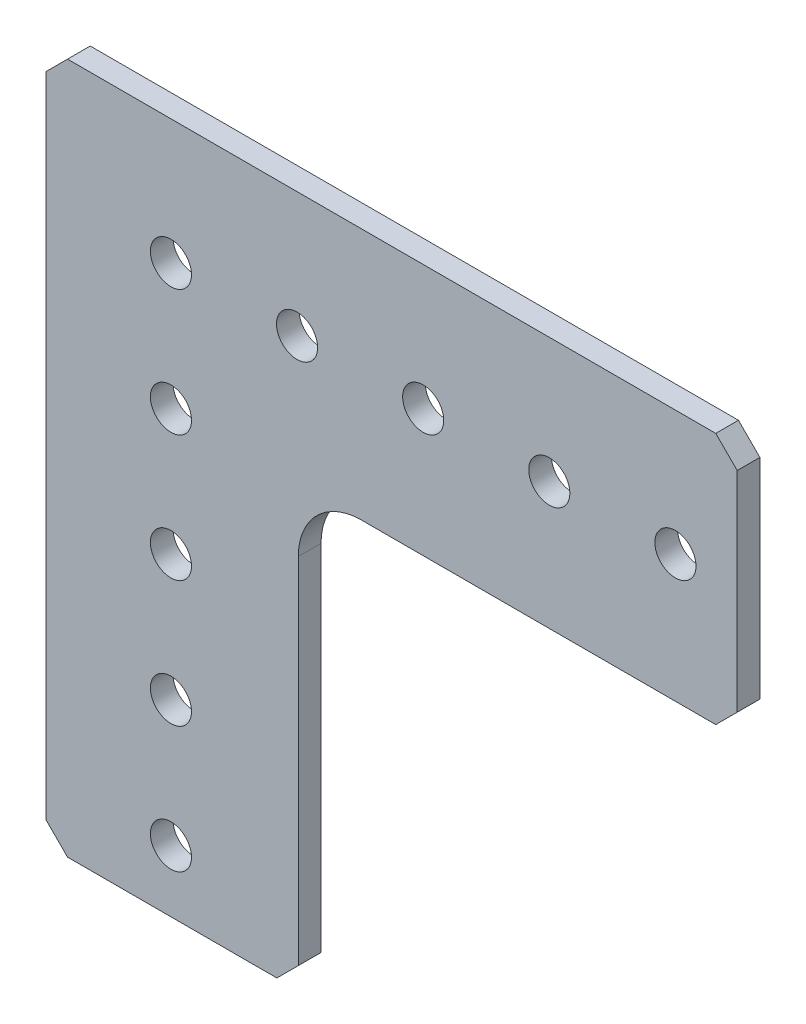
ISO-10303-21;
HEADER;
FILE_DESCRIPTION(('STEP AP214'),'2;1');
FILE_NAME('part.step','',(''),(''),'','','');
FILE_SCHEMA(('AUTOMOTIVE_DESIGN { 1 0 10303 214 1 1 1 1 }'));
ENDSEC;
DATA;
#1=APPLICATION_CONTEXT('core data for automotive mechanical design processes');
#2=APPLICATION_PROTOCOL_DEFINITION('international standard','automotive_design',2000,#1);
#3=PRODUCT_CONTEXT('',#1,'mechanical');
#4=PRODUCT('Part','Part','',(#3));
#5=PRODUCT_RELATED_PRODUCT_CATEGORY('part','',(#4));
#6=PRODUCT_DEFINITION_FORMATION('','',#4);
#7=PRODUCT_DEFINITION_CONTEXT('part definition',#1,'design');
#8=PRODUCT_DEFINITION('design','',#6,#7);
#9=PRODUCT_DEFINITION_SHAPE('','',#8);
#10=(LENGTH_UNIT() NAMED_UNIT(*) SI_UNIT(.MILLI.,.METRE.));
#11=(NAMED_UNIT(*) PLANE_ANGLE_UNIT() SI_UNIT($,.RADIAN.));
#12=(NAMED_UNIT(*) SI_UNIT($,.STERADIAN.) SOLID_ANGLE_UNIT());
#13=UNCERTAINTY_MEASURE_WITH_UNIT(LENGTH_MEASURE(1.E-05),#10,'distance_accuracy_value','');
#14=(GEOMETRIC_REPRESENTATION_CONTEXT(3) GLOBAL_UNCERTAINTY_ASSIGNED_CONTEXT((#13)) GLOBAL_UNIT_ASSIGNED_CONTEXT((#10,
#11,#12)) REPRESENTATION_CONTEXT('',''));
#15=CARTESIAN_POINT('',(0.,0.,0.));
#16=DIRECTION('',(0.,0.,1.));
#17=DIRECTION('',(1.,0.,0.));
#18=AXIS2_PLACEMENT_3D('',#15,#16,#17);
#19=CARTESIAN_POINT('',(-12.573,10.414,2.286));
#20=DIRECTION('',(-0.70710678118655,0.707106781186545,0.));
#21=DIRECTION('',(-0.707106781186545,-0.70710678118655,0.));
#22=AXIS2_PLACEMENT_3D('',#19,#20,#21);
#23=PLANE('',#22);
#24=DIRECTION('',(0.707106781186545,0.70710678118655,0.));
#25=VECTOR('',#24,1.);
#26=CARTESIAN_POINT('',(-12.573,10.414,0.));
#27=LINE('',#26,#25);
#28=CARTESIAN_POINT('',(-12.573,10.414,0.));
#29=VERTEX_POINT('',#28);
#30=CARTESIAN_POINT('',(-10.414,12.573,0.));
#31=VERTEX_POINT('',#30);
#32=EDGE_CURVE('E154',#29,#31,#27,.T.);
#33=ORIENTED_EDGE('',*,*,#32,.F.);
#34=DIRECTION('',(0.,0.,-1.));
#35=VECTOR('',#34,1.);
#36=CARTESIAN_POINT('',(-12.573,10.414,2.286));
#37=LINE('',#36,#35);
#38=CARTESIAN_POINT('',(-12.573,10.414,2.286));
#39=VERTEX_POINT('',#38);
#40=EDGE_CURVE('E11',#39,#29,#37,.T.);
#41=ORIENTED_EDGE('',*,*,#40,.F.);
#42=DIRECTION('',(0.707106781186545,0.70710678118655,0.));
#43=VECTOR('',#42,1.);
#44=CARTESIAN_POINT('',(-12.573,10.414,2.286));
#45=LINE('',#44,#43);
#46=CARTESIAN_POINT('',(-10.414,12.573,2.286));
#47=VERTEX_POINT('',#46);
#48=EDGE_CURVE('E187',#39,#47,#45,.T.);
#49=ORIENTED_EDGE('',*,*,#48,.T.);
#50=DIRECTION('',(0.,0.,-1.));
#51=VECTOR('',#50,1.);
#52=CARTESIAN_POINT('',(-10.414,12.573,2.286));
#53=LINE('',#52,#51);
#54=EDGE_CURVE('E36',#47,#31,#53,.T.);
#55=ORIENTED_EDGE('',*,*,#54,.T.);
#56=EDGE_LOOP('',(#33,#41,#49,#55));
#57=FACE_BOUND('',#56,.T.);
#58=ADVANCED_FACE('F33',(#57),#23,.T.);
#59=CARTESIAN_POINT('',(-12.573,-54.864,2.286));
#60=DIRECTION('',(-1.,0.,0.));
#61=DIRECTION('',(0.,-1.,0.));
#62=AXIS2_PLACEMENT_3D('',#59,#60,#61);
#63=PLANE('',#62);
#64=DIRECTION('',(0.,1.,0.));
#65=VECTOR('',#64,1.);
#66=CARTESIAN_POINT('',(-12.573,-54.864,0.));
#67=LINE('',#66,#65);
#68=CARTESIAN_POINT('',(-12.573,-54.864,0.));
#69=VERTEX_POINT('',#68);
#70=EDGE_CURVE('E185',#69,#29,#67,.T.);
#71=ORIENTED_EDGE('',*,*,#70,.F.);
#72=DIRECTION('',(0.,0.,-1.));
#73=VECTOR('',#72,1.);
#74=CARTESIAN_POINT('',(-12.573,-54.864,2.286));
#75=LINE('',#74,#73);
#76=CARTESIAN_POINT('',(-12.573,-54.864,2.286));
#77=VERTEX_POINT('',#76);
#78=EDGE_CURVE('E42',#77,#69,#75,.T.);
#79=ORIENTED_EDGE('',*,*,#78,.F.);
#80=DIRECTION('',(0.,1.,0.));
#81=VECTOR('',#80,1.);
#82=CARTESIAN_POINT('',(-12.573,-54.864,2.286));
#83=LINE('',#82,#81);
#84=EDGE_CURVE('E144',#77,#39,#83,.T.);
#85=ORIENTED_EDGE('',*,*,#84,.T.);
#86=ORIENTED_EDGE('',*,*,#40,.T.);
#87=EDGE_LOOP('',(#71,#79,#85,#86));
#88=FACE_BOUND('',#87,.T.);
#89=ADVANCED_FACE('F207',(#88),#63,.T.);
#90=CARTESIAN_POINT('',(-10.414,-57.023,2.286));
#91=DIRECTION('',(-0.70710678118654,-0.707106781186555,0.));
#92=DIRECTION('',(0.707106781186555,-0.70710678118654,0.));
#93=AXIS2_PLACEMENT_3D('',#90,#91,#92);
#94=PLANE('',#93);
#95=DIRECTION('',(-0.707106781186555,0.70710678118654,0.));
#96=VECTOR('',#95,1.);
#97=CARTESIAN_POINT('',(-10.414,-57.023,0.));
#98=LINE('',#97,#96);
#99=CARTESIAN_POINT('',(-10.414,-57.023,0.));
#100=VERTEX_POINT('',#99);
#101=EDGE_CURVE('E131',#100,#69,#98,.T.);
#102=ORIENTED_EDGE('',*,*,#101,.F.);
#103=DIRECTION('',(0.,0.,-1.));
#104=VECTOR('',#103,1.);
#105=CARTESIAN_POINT('',(-10.414,-57.023,2.286));
#106=LINE('',#105,#104);
#107=CARTESIAN_POINT('',(-10.414,-57.023,2.286));
#108=VERTEX_POINT('',#107);
#109=EDGE_CURVE('E126',#108,#100,#106,.T.);
#110=ORIENTED_EDGE('',*,*,#109,.F.);
#111=DIRECTION('',(-0.707106781186555,0.70710678118654,0.));
#112=VECTOR('',#111,1.);
#113=CARTESIAN_POINT('',(-10.414,-57.023,2.286));
#114=LINE('',#113,#112);
#115=EDGE_CURVE('E129',#108,#77,#114,.T.);
#116=ORIENTED_EDGE('',*,*,#115,.T.);
#117=ORIENTED_EDGE('',*,*,#78,.T.);
#118=EDGE_LOOP('',(#102,#110,#116,#117));
#119=FACE_BOUND('',#118,.T.);
#120=ADVANCED_FACE('F128',(#119),#94,.T.);
#121=CARTESIAN_POINT('',(10.668,-57.023,2.286));
#122=DIRECTION('',(0.,-1.,0.));
#123=DIRECTION('',(1.,0.,0.));
#124=AXIS2_PLACEMENT_3D('',#121,#122,#123);
#125=PLANE('',#124);
#126=DIRECTION('',(-1.,0.,0.));
#127=VECTOR('',#126,1.);
#128=CARTESIAN_POINT('',(10.668,-57.023,0.));
#129=LINE('',#128,#127);
#130=CARTESIAN_POINT('',(10.668,-57.023,0.));
#131=VERTEX_POINT('',#130);
#132=EDGE_CURVE('E182',#131,#100,#129,.T.);
#133=ORIENTED_EDGE('',*,*,#132,.F.);
#134=DIRECTION('',(0.,0.,-1.));
#135=VECTOR('',#134,1.);
#136=CARTESIAN_POINT('',(10.668,-57.023,2.286));
#137=LINE('',#136,#135);
#138=CARTESIAN_POINT('',(10.668,-57.023,2.286));
#139=VERTEX_POINT('',#138);
#140=EDGE_CURVE('E136',#139,#131,#137,.T.);
#141=ORIENTED_EDGE('',*,*,#140,.F.);
#142=DIRECTION('',(-1.,0.,0.));
#143=VECTOR('',#142,1.);
#144=CARTESIAN_POINT('',(10.668,-57.023,2.286));
#145=LINE('',#144,#143);
#146=EDGE_CURVE('E142',#139,#108,#145,.T.);
#147=ORIENTED_EDGE('',*,*,#146,.T.);
#148=ORIENTED_EDGE('',*,*,#109,.T.);
#149=EDGE_LOOP('',(#133,#141,#147,#148));
#150=FACE_BOUND('',#149,.T.);
#151=ADVANCED_FACE('F146',(#150),#125,.T.);
#152=CARTESIAN_POINT('',(12.827,-54.864,2.286));
#153=DIRECTION('',(0.707106781186551,-0.707106781186544,0.));
#154=DIRECTION('',(0.707106781186544,0.707106781186551,0.));
#155=AXIS2_PLACEMENT_3D('',#152,#153,#154);
#156=PLANE('',#155);
#157=DIRECTION('',(-0.707106781186544,-0.707106781186551,0.));
#158=VECTOR('',#157,1.);
#159=CARTESIAN_POINT('',(12.827,-54.864,0.));
#160=LINE('',#159,#158);
#161=CARTESIAN_POINT('',(12.827,-54.864,0.));
#162=VERTEX_POINT('',#161);
#163=EDGE_CURVE('E179',#162,#131,#160,.T.);
#164=ORIENTED_EDGE('',*,*,#163,.F.);
#165=DIRECTION('',(0.,0.,-1.));
#166=VECTOR('',#165,1.);
#167=CARTESIAN_POINT('',(12.827,-54.864,2.286));
#168=LINE('',#167,#166);
#169=CARTESIAN_POINT('',(12.827,-54.864,2.286));
#170=VERTEX_POINT('',#169);
#171=EDGE_CURVE('E191',#170,#162,#168,.T.);
#172=ORIENTED_EDGE('',*,*,#171,.F.);
#173=DIRECTION('',(-0.707106781186544,-0.707106781186551,0.));
#174=VECTOR('',#173,1.);
#175=CARTESIAN_POINT('',(12.827,-54.864,2.286));
#176=LINE('',#175,#174);
#177=EDGE_CURVE('E147',#170,#139,#176,.T.);
#178=ORIENTED_EDGE('',*,*,#177,.T.);
#179=ORIENTED_EDGE('',*,*,#140,.T.);
#180=EDGE_LOOP('',(#164,#172,#178,#179));
#181=FACE_BOUND('',#180,.T.);
#182=ADVANCED_FACE('F220',(#181),#156,.T.);
#183=CARTESIAN_POINT('',(12.827,-19.177,2.286));
#184=DIRECTION('',(1.,0.,0.));
#185=DIRECTION('',(0.,1.,0.));
#186=AXIS2_PLACEMENT_3D('',#183,#184,#185);
#187=PLANE('',#186);
#188=DIRECTION('',(0.,-1.,0.));
#189=VECTOR('',#188,1.);
#190=CARTESIAN_POINT('',(12.827,-19.177,0.));
#191=LINE('',#190,#189);
#192=CARTESIAN_POINT('',(12.827,-19.177,0.));
#193=VERTEX_POINT('',#192);
#194=EDGE_CURVE('E176',#193,#162,#191,.T.);
#195=ORIENTED_EDGE('',*,*,#194,.F.);
#196=DIRECTION('',(0.,0.,-1.));
#197=VECTOR('',#196,1.);
#198=CARTESIAN_POINT('',(12.827,-19.177,2.286));
#199=LINE('',#198,#197);
#200=CARTESIAN_POINT('',(12.827,-19.177,2.286));
#201=VERTEX_POINT('',#200);
#202=EDGE_CURVE('E193',#201,#193,#199,.T.);
#203=ORIENTED_EDGE('',*,*,#202,.F.);
#204=DIRECTION('',(0.,-1.,0.));
#205=VECTOR('',#204,1.);
#206=CARTESIAN_POINT('',(12.827,-19.177,2.286));
#207=LINE('',#206,#205);
#208=EDGE_CURVE('E149',#201,#170,#207,.T.);
#209=ORIENTED_EDGE('',*,*,#208,.T.);
#210=ORIENTED_EDGE('',*,*,#171,.T.);
#211=EDGE_LOOP('',(#195,#203,#209,#210));
#212=FACE_BOUND('',#211,.T.);
#213=ADVANCED_FACE('F223',(#212),#187,.T.);
#214=CARTESIAN_POINT('',(19.177,-19.177,2.286));
#215=DIRECTION('',(0.,0.,-1.));
#216=DIRECTION('',(-1.,0.,0.));
#217=AXIS2_PLACEMENT_3D('',#214,#215,#216);
#218=CYLINDRICAL_SURFACE('',#217,6.35);
#219=CARTESIAN_POINT('',(19.177,-19.177,0.));
#220=DIRECTION('',(0.,0.,1.));
#221=DIRECTION('',(1.,0.,0.));
#222=AXIS2_PLACEMENT_3D('',#219,#220,#221);
#223=CIRCLE('',#222,6.35);
#224=CARTESIAN_POINT('',(19.177,-12.827,0.));
#225=VERTEX_POINT('',#224);
#226=EDGE_CURVE('E173',#225,#193,#223,.T.);
#227=ORIENTED_EDGE('',*,*,#226,.F.);
#228=DIRECTION('',(0.,0.,-1.));
#229=VECTOR('',#228,1.);
#230=CARTESIAN_POINT('',(19.177,-12.827,2.286));
#231=LINE('',#230,#229);
#232=CARTESIAN_POINT('',(19.177,-12.827,2.286));
#233=VERTEX_POINT('',#232);
#234=EDGE_CURVE('E195',#233,#225,#231,.T.);
#235=ORIENTED_EDGE('',*,*,#234,.F.);
#236=CARTESIAN_POINT('',(19.177,-19.177,2.286));
#237=DIRECTION('',(0.,0.,1.));
#238=DIRECTION('',(1.,0.,0.));
#239=AXIS2_PLACEMENT_3D('',#236,#237,#238);
#240=CIRCLE('',#239,6.35);
#241=EDGE_CURVE('E367',#233,#201,#240,.T.);
#242=ORIENTED_EDGE('',*,*,#241,.T.);
#243=ORIENTED_EDGE('',*,*,#202,.T.);
#244=EDGE_LOOP('',(#227,#235,#242,#243));
#245=FACE_BOUND('',#244,.T.);
#246=ADVANCED_FACE('F227',(#245),#218,.F.);
#247=CARTESIAN_POINT('',(54.864,-12.827,2.286));
#248=DIRECTION('',(0.,-1.,0.));
#249=DIRECTION('',(1.,0.,0.));
#250=AXIS2_PLACEMENT_3D('',#247,#248,#249);
#251=PLANE('',#250);
#252=DIRECTION('',(-1.,0.,0.));
#253=VECTOR('',#252,1.);
#254=CARTESIAN_POINT('',(54.864,-12.827,0.));
#255=LINE('',#254,#253);
#256=CARTESIAN_POINT('',(54.864,-12.827,0.));
#257=VERTEX_POINT('',#256);
#258=EDGE_CURVE('E170',#257,#225,#255,.T.);
#259=ORIENTED_EDGE('',*,*,#258,.F.);
#260=DIRECTION('',(0.,0.,-1.));
#261=VECTOR('',#260,1.);
#262=CARTESIAN_POINT('',(54.864,-12.827,2.286));
#263=LINE('',#262,#261);
#264=CARTESIAN_POINT('',(54.864,-12.827,2.286));
#265=VERTEX_POINT('',#264);
#266=EDGE_CURVE('E197',#265,#257,#263,.T.);
#267=ORIENTED_EDGE('',*,*,#266,.F.);
#268=DIRECTION('',(-1.,0.,0.));
#269=VECTOR('',#268,1.);
#270=CARTESIAN_POINT('',(54.864,-12.827,2.286));
#271=LINE('',#270,#269);
#272=EDGE_CURVE('E364',#265,#233,#271,.T.);
#273=ORIENTED_EDGE('',*,*,#272,.T.);
#274=ORIENTED_EDGE('',*,*,#234,.T.);
#275=EDGE_LOOP('',(#259,#267,#273,#274));
#276=FACE_BOUND('',#275,.T.);
#277=ADVANCED_FACE('F231',(#276),#251,.T.);
#278=CARTESIAN_POINT('',(57.023,-10.668,2.286));
#279=DIRECTION('',(0.707106781186546,-0.707106781186549,0.));
#280=DIRECTION('',(0.707106781186549,0.707106781186546,0.));
#281=AXIS2_PLACEMENT_3D('',#278,#279,#280);
#282=PLANE('',#281);
#283=DIRECTION('',(-0.707106781186549,-0.707106781186546,0.));
#284=VECTOR('',#283,1.);
#285=CARTESIAN_POINT('',(57.023,-10.668,0.));
#286=LINE('',#285,#284);
#287=CARTESIAN_POINT('',(57.023,-10.668,0.));
#288=VERTEX_POINT('',#287);
#289=EDGE_CURVE('E167',#288,#257,#286,.T.);
#290=ORIENTED_EDGE('',*,*,#289,.F.);
#291=DIRECTION('',(0.,0.,-1.));
#292=VECTOR('',#291,1.);
#293=CARTESIAN_POINT('',(57.023,-10.668,2.286));
#294=LINE('',#293,#292);
#295=CARTESIAN_POINT('',(57.023,-10.668,2.286));
#296=VERTEX_POINT('',#295);
#297=EDGE_CURVE('E199',#296,#288,#294,.T.);
#298=ORIENTED_EDGE('',*,*,#297,.F.);
#299=DIRECTION('',(-0.707106781186549,-0.707106781186546,0.));
#300=VECTOR('',#299,1.);
#301=CARTESIAN_POINT('',(57.023,-10.668,2.286));
#302=LINE('',#301,#300);
#303=EDGE_CURVE('E361',#296,#265,#302,.T.);
#304=ORIENTED_EDGE('',*,*,#303,.T.);
#305=ORIENTED_EDGE('',*,*,#266,.T.);
#306=EDGE_LOOP('',(#290,#298,#304,#305));
#307=FACE_BOUND('',#306,.T.);
#308=ADVANCED_FACE('F235',(#307),#282,.T.);
#309=CARTESIAN_POINT('',(57.023,10.414,2.286));
#310=DIRECTION('',(1.,0.,0.));
#311=DIRECTION('',(0.,1.,0.));
#312=AXIS2_PLACEMENT_3D('',#309,#310,#311);
#313=PLANE('',#312);
#314=DIRECTION('',(0.,-1.,0.));
#315=VECTOR('',#314,1.);
#316=CARTESIAN_POINT('',(57.023,10.414,0.));
#317=LINE('',#316,#315);
#318=CARTESIAN_POINT('',(57.023,10.414,0.));
#319=VERTEX_POINT('',#318);
#320=EDGE_CURVE('E164',#319,#288,#317,.T.);
#321=ORIENTED_EDGE('',*,*,#320,.F.);
#322=DIRECTION('',(0.,0.,-1.));
#323=VECTOR('',#322,1.);
#324=CARTESIAN_POINT('',(57.023,10.414,2.286));
#325=LINE('',#324,#323);
#326=CARTESIAN_POINT('',(57.023,10.414,2.286));
#327=VERTEX_POINT('',#326);
#328=EDGE_CURVE('E201',#327,#319,#325,.T.);
#329=ORIENTED_EDGE('',*,*,#328,.F.);
#330=DIRECTION('',(0.,-1.,0.));
#331=VECTOR('',#330,1.);
#332=CARTESIAN_POINT('',(57.023,10.414,2.286));
#333=LINE('',#332,#331);
#334=EDGE_CURVE('E358',#327,#296,#333,.T.);
#335=ORIENTED_EDGE('',*,*,#334,.T.);
#336=ORIENTED_EDGE('',*,*,#297,.T.);
#337=EDGE_LOOP('',(#321,#329,#335,#336));
#338=FACE_BOUND('',#337,.T.);
#339=ADVANCED_FACE('F239',(#338),#313,.T.);
#340=CARTESIAN_POINT('',(54.864,12.573,2.286));
#341=DIRECTION('',(0.707106781186542,0.707106781186554,0.));
#342=DIRECTION('',(-0.707106781186554,0.707106781186542,0.));
#343=AXIS2_PLACEMENT_3D('',#340,#341,#342);
#344=PLANE('',#343);
#345=DIRECTION('',(0.707106781186553,-0.707106781186541,0.));
#346=VECTOR('',#345,1.);
#347=CARTESIAN_POINT('',(54.864,12.573,0.));
#348=LINE('',#347,#346);
#349=CARTESIAN_POINT('',(54.864,12.573,0.));
#350=VERTEX_POINT('',#349);
#351=EDGE_CURVE('E161',#350,#319,#348,.T.);
#352=ORIENTED_EDGE('',*,*,#351,.F.);
#353=DIRECTION('',(0.,0.,-1.));
#354=VECTOR('',#353,1.);
#355=CARTESIAN_POINT('',(54.864,12.573,2.286));
#356=LINE('',#355,#354);
#357=CARTESIAN_POINT('',(54.864,12.573,2.286));
#358=VERTEX_POINT('',#357);
#359=EDGE_CURVE('E202',#358,#350,#356,.T.);
#360=ORIENTED_EDGE('',*,*,#359,.F.);
#361=DIRECTION('',(0.707106781186553,-0.707106781186541,0.));
#362=VECTOR('',#361,1.);
#363=CARTESIAN_POINT('',(54.864,12.573,2.286));
#364=LINE('',#363,#362);
#365=EDGE_CURVE('E355',#358,#327,#364,.T.);
#366=ORIENTED_EDGE('',*,*,#365,.T.);
#367=ORIENTED_EDGE('',*,*,#328,.T.);
#368=EDGE_LOOP('',(#352,#360,#366,#367));
#369=FACE_BOUND('',#368,.T.);
#370=ADVANCED_FACE('F243',(#369),#344,.T.);
#371=CARTESIAN_POINT('',(-10.414,12.573,2.286));
#372=DIRECTION('',(0.,1.,0.));
#373=DIRECTION('',(0.,0.,1.));
#374=AXIS2_PLACEMENT_3D('',#371,#372,#373);
#375=PLANE('',#374);
#376=DIRECTION('',(1.,0.,0.));
#377=VECTOR('',#376,1.);
#378=CARTESIAN_POINT('',(-10.414,12.573,0.));
#379=LINE('',#378,#377);
#380=EDGE_CURVE('E157',#31,#350,#379,.T.);
#381=ORIENTED_EDGE('',*,*,#380,.F.);
#382=ORIENTED_EDGE('',*,*,#54,.F.);
#383=DIRECTION('',(1.,0.,0.));
#384=VECTOR('',#383,1.);
#385=CARTESIAN_POINT('',(-10.414,12.573,2.286));
#386=LINE('',#385,#384);
#387=EDGE_CURVE('E353',#47,#358,#386,.T.);
#388=ORIENTED_EDGE('',*,*,#387,.T.);
#389=ORIENTED_EDGE('',*,*,#359,.T.);
#390=EDGE_LOOP('',(#381,#382,#388,#389));
#391=FACE_BOUND('',#390,.T.);
#392=ADVANCED_FACE('F204',(#391),#375,.T.);
#393=CARTESIAN_POINT('',(19.177,-19.177,2.286));
#394=DIRECTION('',(0.,0.,1.));
#395=DIRECTION('',(1.,0.,0.));
#396=AXIS2_PLACEMENT_3D('',#393,#394,#395);
#397=PLANE('',#396);
#398=CARTESIAN_POINT('',(50.8,0.,2.286));
#399=DIRECTION('',(0.,0.,-1.));
#400=DIRECTION('',(1.,0.,0.));
#401=AXIS2_PLACEMENT_3D('',#398,#399,#400);
#402=CIRCLE('',#401,2.0701);
#403=CARTESIAN_POINT('',(52.8701,0.,2.286));
#404=VERTEX_POINT('',#403);
#405=EDGE_CURVE('E298',#404,#404,#402,.T.);
#406=ORIENTED_EDGE('',*,*,#405,.T.);
#407=EDGE_LOOP('',(#406));
#408=FACE_BOUND('',#407,.T.);
#409=CARTESIAN_POINT('',(3.9907631702977E-13,-38.1,2.286));
#410=DIRECTION('',(0.,0.,-1.));
#411=DIRECTION('',(1.,0.,0.));
#412=AXIS2_PLACEMENT_3D('',#409,#410,#411);
#413=CIRCLE('',#412,2.0701);
#414=CARTESIAN_POINT('',(2.0701000000004,-38.1,2.286));
#415=VERTEX_POINT('',#414);
#416=EDGE_CURVE('E306',#415,#415,#413,.T.);
#417=ORIENTED_EDGE('',*,*,#416,.T.);
#418=EDGE_LOOP('',(#417));
#419=FACE_BOUND('',#418,.T.);
#420=CARTESIAN_POINT('',(1.33025439009923E-13,-12.7,2.286));
#421=DIRECTION('',(0.,0.,-1.));
#422=DIRECTION('',(1.,0.,0.));
#423=AXIS2_PLACEMENT_3D('',#420,#421,#422);
#424=CIRCLE('',#423,2.0701);
#425=CARTESIAN_POINT('',(2.07010000000013,-12.7,2.286));
#426=VERTEX_POINT('',#425);
#427=EDGE_CURVE('E312',#426,#426,#424,.T.);
#428=ORIENTED_EDGE('',*,*,#427,.T.);
#429=EDGE_LOOP('',(#428));
#430=FACE_BOUND('',#429,.T.);
#431=CARTESIAN_POINT('',(25.4,3.54734504026462E-13,2.286));
#432=DIRECTION('',(0.,0.,-1.));
#433=DIRECTION('',(1.,0.,0.));
#434=AXIS2_PLACEMENT_3D('',#431,#432,#433);
#435=CIRCLE('',#434,2.0701);
#436=CARTESIAN_POINT('',(27.4701,3.54734504026462E-13,2.286));
#437=VERTEX_POINT('',#436);
#438=EDGE_CURVE('E318',#437,#437,#435,.T.);
#439=ORIENTED_EDGE('',*,*,#438,.T.);
#440=EDGE_LOOP('',(#439));
#441=FACE_BOUND('',#440,.T.);
#442=CARTESIAN_POINT('',(0.,0.,2.286));
#443=DIRECTION('',(0.,0.,-1.));
#444=DIRECTION('',(1.,0.,0.));
#445=AXIS2_PLACEMENT_3D('',#442,#443,#444);
#446=CIRCLE('',#445,2.0701);
#447=CARTESIAN_POINT('',(2.0701,0.,2.286));
#448=VERTEX_POINT('',#447);
#449=EDGE_CURVE('E324',#448,#448,#446,.T.);
#450=ORIENTED_EDGE('',*,*,#449,.T.);
#451=EDGE_LOOP('',(#450));
#452=FACE_BOUND('',#451,.T.);
#453=CARTESIAN_POINT('',(12.7,1.77367252013231E-13,2.286));
#454=DIRECTION('',(0.,0.,-1.));
#455=DIRECTION('',(1.,0.,0.));
#456=AXIS2_PLACEMENT_3D('',#453,#454,#455);
#457=CIRCLE('',#456,2.0701);
#458=CARTESIAN_POINT('',(14.7701,1.77367252013231E-13,2.286));
#459=VERTEX_POINT('',#458);
#460=EDGE_CURVE('E330',#459,#459,#457,.T.);
#461=ORIENTED_EDGE('',*,*,#460,.T.);
#462=EDGE_LOOP('',(#461));
#463=FACE_BOUND('',#462,.T.);
#464=CARTESIAN_POINT('',(38.1,0.,2.286));
#465=DIRECTION('',(0.,0.,-1.));
#466=DIRECTION('',(1.,0.,0.));
#467=AXIS2_PLACEMENT_3D('',#464,#465,#466);
#468=CIRCLE('',#467,2.0701);
#469=CARTESIAN_POINT('',(40.1701,0.,2.286));
#470=VERTEX_POINT('',#469);
#471=EDGE_CURVE('E336',#470,#470,#468,.T.);
#472=ORIENTED_EDGE('',*,*,#471,.T.);
#473=EDGE_LOOP('',(#472));
#474=FACE_BOUND('',#473,.T.);
#475=CARTESIAN_POINT('',(2.66050878019847E-13,-25.4,2.286));
#476=DIRECTION('',(0.,0.,-1.));
#477=DIRECTION('',(1.,0.,0.));
#478=AXIS2_PLACEMENT_3D('',#475,#476,#477);
#479=CIRCLE('',#478,2.0701);
#480=CARTESIAN_POINT('',(2.07010000000027,-25.4,2.286));
#481=VERTEX_POINT('',#480);
#482=EDGE_CURVE('E342',#481,#481,#479,.T.);
#483=ORIENTED_EDGE('',*,*,#482,.T.);
#484=EDGE_LOOP('',(#483));
#485=FACE_BOUND('',#484,.T.);
#486=CARTESIAN_POINT('',(0.,-50.8,2.286));
#487=DIRECTION('',(0.,0.,-1.));
#488=DIRECTION('',(1.,0.,0.));
#489=AXIS2_PLACEMENT_3D('',#486,#487,#488);
#490=CIRCLE('',#489,2.0701);
#491=CARTESIAN_POINT('',(2.07010000000001,-50.8,2.286));
#492=VERTEX_POINT('',#491);
#493=EDGE_CURVE('E158',#492,#492,#490,.T.);
#494=ORIENTED_EDGE('',*,*,#493,.T.);
#495=EDGE_LOOP('',(#494));
#496=FACE_BOUND('',#495,.T.);
#497=ORIENTED_EDGE('',*,*,#48,.F.);
#498=ORIENTED_EDGE('',*,*,#84,.F.);
#499=ORIENTED_EDGE('',*,*,#115,.F.);
#500=ORIENTED_EDGE('',*,*,#146,.F.);
#501=ORIENTED_EDGE('',*,*,#177,.F.);
#502=ORIENTED_EDGE('',*,*,#208,.F.);
#503=ORIENTED_EDGE('',*,*,#241,.F.);
#504=ORIENTED_EDGE('',*,*,#272,.F.);
#505=ORIENTED_EDGE('',*,*,#303,.F.);
#506=ORIENTED_EDGE('',*,*,#334,.F.);
#507=ORIENTED_EDGE('',*,*,#365,.F.);
#508=ORIENTED_EDGE('',*,*,#387,.F.);
#509=EDGE_LOOP('',(#497,#498,#499,#500,#501,#502,#503,#504,#505,#506,#507,#508));
#510=FACE_BOUND('',#509,.T.);
#511=ADVANCED_FACE('F140',(#408,#419,#430,#441,#452,#463,#474,#485,#496,#510),#397,.T.);
#512=CARTESIAN_POINT('',(19.177,-19.177,0.));
#513=DIRECTION('',(0.,0.,1.));
#514=DIRECTION('',(1.,0.,0.));
#515=AXIS2_PLACEMENT_3D('',#512,#513,#514);
#516=PLANE('',#515);
#517=CARTESIAN_POINT('',(50.8,0.,0.));
#518=DIRECTION('',(0.,0.,-1.));
#519=DIRECTION('',(1.,0.,0.));
#520=AXIS2_PLACEMENT_3D('',#517,#518,#519);
#521=CIRCLE('',#520,2.0701);
#522=CARTESIAN_POINT('',(52.8701,0.,0.));
#523=VERTEX_POINT('',#522);
#524=EDGE_CURVE('E301',#523,#523,#521,.T.);
#525=ORIENTED_EDGE('',*,*,#524,.F.);
#526=EDGE_LOOP('',(#525));
#527=FACE_BOUND('',#526,.T.);
#528=CARTESIAN_POINT('',(3.9907631702977E-13,-38.1,0.));
#529=DIRECTION('',(0.,0.,-1.));
#530=DIRECTION('',(1.,0.,0.));
#531=AXIS2_PLACEMENT_3D('',#528,#529,#530);
#532=CIRCLE('',#531,2.0701);
#533=CARTESIAN_POINT('',(2.0701000000004,-38.1,0.));
#534=VERTEX_POINT('',#533);
#535=EDGE_CURVE('E303',#534,#534,#532,.T.);
#536=ORIENTED_EDGE('',*,*,#535,.F.);
#537=EDGE_LOOP('',(#536));
#538=FACE_BOUND('',#537,.T.);
#539=CARTESIAN_POINT('',(1.33025439009923E-13,-12.7,0.));
#540=DIRECTION('',(0.,0.,-1.));
#541=DIRECTION('',(1.,0.,0.));
#542=AXIS2_PLACEMENT_3D('',#539,#540,#541);
#543=CIRCLE('',#542,2.0701);
#544=CARTESIAN_POINT('',(2.07010000000013,-12.7,0.));
#545=VERTEX_POINT('',#544);
#546=EDGE_CURVE('E309',#545,#545,#543,.T.);
#547=ORIENTED_EDGE('',*,*,#546,.F.);
#548=EDGE_LOOP('',(#547));
#549=FACE_BOUND('',#548,.T.);
#550=CARTESIAN_POINT('',(25.4,3.54734504026462E-13,0.));
#551=DIRECTION('',(0.,0.,-1.));
#552=DIRECTION('',(1.,0.,0.));
#553=AXIS2_PLACEMENT_3D('',#550,#551,#552);
#554=CIRCLE('',#553,2.0701);
#555=CARTESIAN_POINT('',(27.4701,3.54734504026462E-13,0.));
#556=VERTEX_POINT('',#555);
#557=EDGE_CURVE('E315',#556,#556,#554,.T.);
#558=ORIENTED_EDGE('',*,*,#557,.F.);
#559=EDGE_LOOP('',(#558));
#560=FACE_BOUND('',#559,.T.);
#561=CARTESIAN_POINT('',(0.,0.,0.));
#562=DIRECTION('',(0.,0.,-1.));
#563=DIRECTION('',(1.,0.,0.));
#564=AXIS2_PLACEMENT_3D('',#561,#562,#563);
#565=CIRCLE('',#564,2.0701);
#566=CARTESIAN_POINT('',(2.0701,0.,0.));
#567=VERTEX_POINT('',#566);
#568=EDGE_CURVE('E321',#567,#567,#565,.T.);
#569=ORIENTED_EDGE('',*,*,#568,.F.);
#570=EDGE_LOOP('',(#569));
#571=FACE_BOUND('',#570,.T.);
#572=CARTESIAN_POINT('',(12.7,1.77367252013231E-13,0.));
#573=DIRECTION('',(0.,0.,-1.));
#574=DIRECTION('',(1.,0.,0.));
#575=AXIS2_PLACEMENT_3D('',#572,#573,#574);
#576=CIRCLE('',#575,2.0701);
#577=CARTESIAN_POINT('',(14.7701,1.77367252013231E-13,0.));
#578=VERTEX_POINT('',#577);
#579=EDGE_CURVE('E327',#578,#578,#576,.T.);
#580=ORIENTED_EDGE('',*,*,#579,.F.);
#581=EDGE_LOOP('',(#580));
#582=FACE_BOUND('',#581,.T.);
#583=CARTESIAN_POINT('',(38.1,0.,0.));
#584=DIRECTION('',(0.,0.,-1.));
#585=DIRECTION('',(1.,0.,0.));
#586=AXIS2_PLACEMENT_3D('',#583,#584,#585);
#587=CIRCLE('',#586,2.0701);
#588=CARTESIAN_POINT('',(40.1701,0.,0.));
#589=VERTEX_POINT('',#588);
#590=EDGE_CURVE('E333',#589,#589,#587,.T.);
#591=ORIENTED_EDGE('',*,*,#590,.F.);
#592=EDGE_LOOP('',(#591));
#593=FACE_BOUND('',#592,.T.);
#594=CARTESIAN_POINT('',(2.66050878019847E-13,-25.4,0.));
#595=DIRECTION('',(0.,0.,-1.));
#596=DIRECTION('',(1.,0.,0.));
#597=AXIS2_PLACEMENT_3D('',#594,#595,#596);
#598=CIRCLE('',#597,2.0701);
#599=CARTESIAN_POINT('',(2.07010000000027,-25.4,0.));
#600=VERTEX_POINT('',#599);
#601=EDGE_CURVE('E339',#600,#600,#598,.T.);
#602=ORIENTED_EDGE('',*,*,#601,.F.);
#603=EDGE_LOOP('',(#602));
#604=FACE_BOUND('',#603,.T.);
#605=CARTESIAN_POINT('',(0.,-50.8,0.));
#606=DIRECTION('',(0.,0.,-1.));
#607=DIRECTION('',(1.,0.,0.));
#608=AXIS2_PLACEMENT_3D('',#605,#606,#607);
#609=CIRCLE('',#608,2.0701);
#610=CARTESIAN_POINT('',(2.07010000000001,-50.8,0.));
#611=VERTEX_POINT('',#610);
#612=EDGE_CURVE('E345',#611,#611,#609,.T.);
#613=ORIENTED_EDGE('',*,*,#612,.F.);
#614=EDGE_LOOP('',(#613));
#615=FACE_BOUND('',#614,.T.);
#616=ORIENTED_EDGE('',*,*,#32,.T.);
#617=ORIENTED_EDGE('',*,*,#380,.T.);
#618=ORIENTED_EDGE('',*,*,#351,.T.);
#619=ORIENTED_EDGE('',*,*,#320,.T.);
#620=ORIENTED_EDGE('',*,*,#289,.T.);
#621=ORIENTED_EDGE('',*,*,#258,.T.);
#622=ORIENTED_EDGE('',*,*,#226,.T.);
#623=ORIENTED_EDGE('',*,*,#194,.T.);
#624=ORIENTED_EDGE('',*,*,#163,.T.);
#625=ORIENTED_EDGE('',*,*,#132,.T.);
#626=ORIENTED_EDGE('',*,*,#101,.T.);
#627=ORIENTED_EDGE('',*,*,#70,.T.);
#628=EDGE_LOOP('',(#616,#617,#618,#619,#620,#621,#622,#623,#624,#625,#626,#627));
#629=FACE_BOUND('',#628,.T.);
#630=ADVANCED_FACE('F206',(#527,#538,#549,#560,#571,#582,#593,#604,#615,#629),#516,.F.);
#631=CARTESIAN_POINT('',(0.,-50.8,2.286));
#632=DIRECTION('',(0.,0.,-1.));
#633=DIRECTION('',(-1.,0.,0.));
#634=AXIS2_PLACEMENT_3D('',#631,#632,#633);
#635=CYLINDRICAL_SURFACE('',#634,2.0701);
#636=ORIENTED_EDGE('',*,*,#493,.F.);
#637=EDGE_LOOP('',(#636));
#638=FACE_BOUND('',#637,.T.);
#639=ORIENTED_EDGE('',*,*,#612,.T.);
#640=EDGE_LOOP('',(#639));
#641=FACE_BOUND('',#640,.T.);
#642=ADVANCED_FACE('F255',(#638,#641),#635,.F.);
#643=CARTESIAN_POINT('',(2.66050878019847E-13,-25.4,2.286));
#644=DIRECTION('',(0.,0.,-1.));
#645=DIRECTION('',(-1.,0.,0.));
#646=AXIS2_PLACEMENT_3D('',#643,#644,#645);
#647=CYLINDRICAL_SURFACE('',#646,2.0701);
#648=ORIENTED_EDGE('',*,*,#482,.F.);
#649=EDGE_LOOP('',(#648));
#650=FACE_BOUND('',#649,.T.);
#651=ORIENTED_EDGE('',*,*,#601,.T.);
#652=EDGE_LOOP('',(#651));
#653=FACE_BOUND('',#652,.T.);
#654=ADVANCED_FACE('F262',(#650,#653),#647,.F.);
#655=CARTESIAN_POINT('',(38.1,0.,2.286));
#656=DIRECTION('',(0.,0.,-1.));
#657=DIRECTION('',(-1.,0.,0.));
#658=AXIS2_PLACEMENT_3D('',#655,#656,#657);
#659=CYLINDRICAL_SURFACE('',#658,2.0701);
#660=ORIENTED_EDGE('',*,*,#471,.F.);
#661=EDGE_LOOP('',(#660));
#662=FACE_BOUND('',#661,.T.);
#663=ORIENTED_EDGE('',*,*,#590,.T.);
#664=EDGE_LOOP('',(#663));
#665=FACE_BOUND('',#664,.T.);
#666=ADVANCED_FACE('F266',(#662,#665),#659,.F.);
#667=CARTESIAN_POINT('',(12.7,1.77367252013231E-13,2.286));
#668=DIRECTION('',(0.,0.,-1.));
#669=DIRECTION('',(-1.,0.,0.));
#670=AXIS2_PLACEMENT_3D('',#667,#668,#669);
#671=CYLINDRICAL_SURFACE('',#670,2.0701);
#672=ORIENTED_EDGE('',*,*,#460,.F.);
#673=EDGE_LOOP('',(#672));
#674=FACE_BOUND('',#673,.T.);
#675=ORIENTED_EDGE('',*,*,#579,.T.);
#676=EDGE_LOOP('',(#675));
#677=FACE_BOUND('',#676,.T.);
#678=ADVANCED_FACE('F270',(#674,#677),#671,.F.);
#679=CARTESIAN_POINT('',(0.,0.,2.286));
#680=DIRECTION('',(0.,0.,-1.));
#681=DIRECTION('',(-1.,0.,0.));
#682=AXIS2_PLACEMENT_3D('',#679,#680,#681);
#683=CYLINDRICAL_SURFACE('',#682,2.0701);
#684=ORIENTED_EDGE('',*,*,#449,.F.);
#685=EDGE_LOOP('',(#684));
#686=FACE_BOUND('',#685,.T.);
#687=ORIENTED_EDGE('',*,*,#568,.T.);
#688=EDGE_LOOP('',(#687));
#689=FACE_BOUND('',#688,.T.);
#690=ADVANCED_FACE('F274',(#686,#689),#683,.F.);
#691=CARTESIAN_POINT('',(25.4,3.54734504026462E-13,2.286));
#692=DIRECTION('',(0.,0.,-1.));
#693=DIRECTION('',(-1.,0.,0.));
#694=AXIS2_PLACEMENT_3D('',#691,#692,#693);
#695=CYLINDRICAL_SURFACE('',#694,2.0701);
#696=ORIENTED_EDGE('',*,*,#438,.F.);
#697=EDGE_LOOP('',(#696));
#698=FACE_BOUND('',#697,.T.);
#699=ORIENTED_EDGE('',*,*,#557,.T.);
#700=EDGE_LOOP('',(#699));
#701=FACE_BOUND('',#700,.T.);
#702=ADVANCED_FACE('F278',(#698,#701),#695,.F.);
#703=CARTESIAN_POINT('',(1.33025439009923E-13,-12.7,2.286));
#704=DIRECTION('',(0.,0.,-1.));
#705=DIRECTION('',(-1.,0.,0.));
#706=AXIS2_PLACEMENT_3D('',#703,#704,#705);
#707=CYLINDRICAL_SURFACE('',#706,2.0701);
#708=ORIENTED_EDGE('',*,*,#427,.F.);
#709=EDGE_LOOP('',(#708));
#710=FACE_BOUND('',#709,.T.);
#711=ORIENTED_EDGE('',*,*,#546,.T.);
#712=EDGE_LOOP('',(#711));
#713=FACE_BOUND('',#712,.T.);
#714=ADVANCED_FACE('F282',(#710,#713),#707,.F.);
#715=CARTESIAN_POINT('',(3.9907631702977E-13,-38.1,2.286));
#716=DIRECTION('',(0.,0.,-1.));
#717=DIRECTION('',(-1.,0.,0.));
#718=AXIS2_PLACEMENT_3D('',#715,#716,#717);
#719=CYLINDRICAL_SURFACE('',#718,2.0701);
#720=ORIENTED_EDGE('',*,*,#416,.F.);
#721=EDGE_LOOP('',(#720));
#722=FACE_BOUND('',#721,.T.);
#723=ORIENTED_EDGE('',*,*,#535,.T.);
#724=EDGE_LOOP('',(#723));
#725=FACE_BOUND('',#724,.T.);
#726=ADVANCED_FACE('F286',(#722,#725),#719,.F.);
#727=CARTESIAN_POINT('',(50.8,0.,2.286));
#728=DIRECTION('',(0.,0.,-1.));
#729=DIRECTION('',(-1.,0.,0.));
#730=AXIS2_PLACEMENT_3D('',#727,#728,#729);
#731=CYLINDRICAL_SURFACE('',#730,2.0701);
#732=ORIENTED_EDGE('',*,*,#405,.F.);
#733=EDGE_LOOP('',(#732));
#734=FACE_BOUND('',#733,.T.);
#735=ORIENTED_EDGE('',*,*,#524,.T.);
#736=EDGE_LOOP('',(#735));
#737=FACE_BOUND('',#736,.T.);
#738=ADVANCED_FACE('F290',(#734,#737),#731,.F.);
#739=CLOSED_SHELL('',(#58,#89,#120,#151,#182,#213,#246,#277,#308,#339,#370,#392,#511,#630,#642,
#654,#666,#678,#690,#702,#714,#726,#738));
#740=MANIFOLD_SOLID_BREP('B2',#739);
#741=ADVANCED_BREP_SHAPE_REPRESENTATION('',(#18,#740),#14);
#742=SHAPE_DEFINITION_REPRESENTATION(#9,#741);
ENDSEC;
END-ISO-10303-21;
